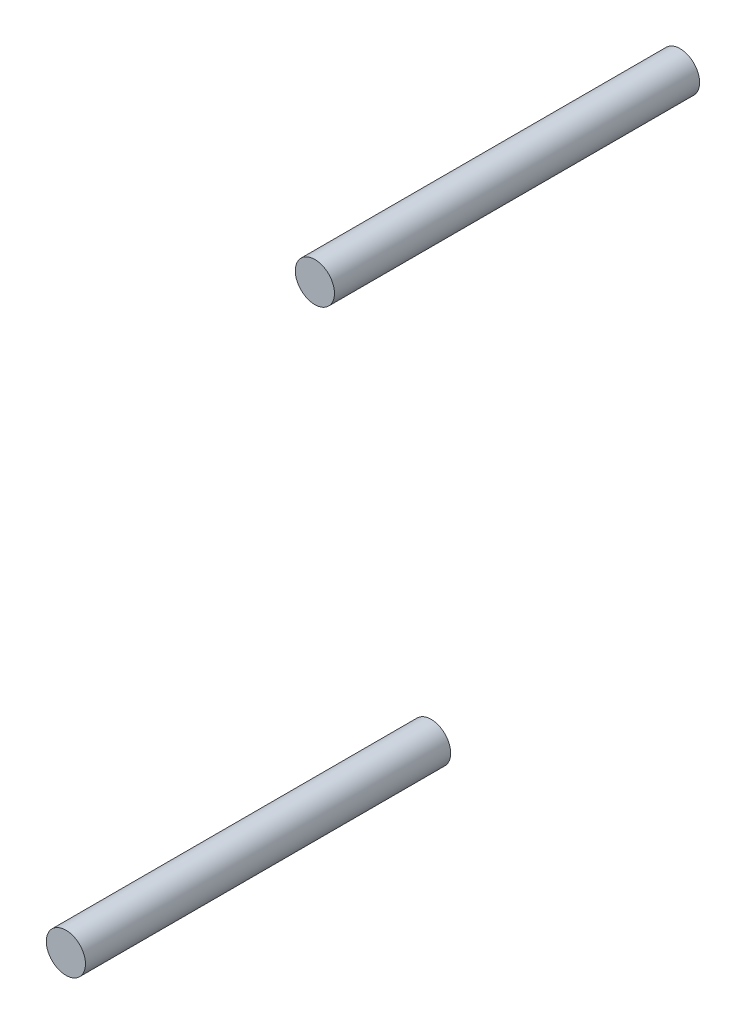
ISO-10303-21;
HEADER;
FILE_DESCRIPTION(('STEP AP214'),'2;1');
FILE_NAME('part.step','',(''),(''),'','','');
FILE_SCHEMA(('AUTOMOTIVE_DESIGN { 1 0 10303 214 1 1 1 1 }'));
ENDSEC;
DATA;
#1=APPLICATION_CONTEXT('core data for automotive mechanical design processes');
#2=APPLICATION_PROTOCOL_DEFINITION('international standard','automotive_design',2000,#1);
#3=PRODUCT_CONTEXT('',#1,'mechanical');
#4=PRODUCT('Part','Part','',(#3));
#5=PRODUCT_RELATED_PRODUCT_CATEGORY('part','',(#4));
#6=PRODUCT_DEFINITION_FORMATION('','',#4);
#7=PRODUCT_DEFINITION_CONTEXT('part definition',#1,'design');
#8=PRODUCT_DEFINITION('design','',#6,#7);
#9=PRODUCT_DEFINITION_SHAPE('','',#8);
#10=(LENGTH_UNIT() NAMED_UNIT(*) SI_UNIT(.MILLI.,.METRE.));
#11=(NAMED_UNIT(*) PLANE_ANGLE_UNIT() SI_UNIT($,.RADIAN.));
#12=(NAMED_UNIT(*) SI_UNIT($,.STERADIAN.) SOLID_ANGLE_UNIT());
#13=UNCERTAINTY_MEASURE_WITH_UNIT(LENGTH_MEASURE(1.E-05),#10,'distance_accuracy_value','');
#14=(GEOMETRIC_REPRESENTATION_CONTEXT(3) GLOBAL_UNCERTAINTY_ASSIGNED_CONTEXT((#13)) GLOBAL_UNIT_ASSIGNED_CONTEXT((#10,
#11,#12)) REPRESENTATION_CONTEXT('',''));
#15=CARTESIAN_POINT('',(0.,0.,0.));
#16=DIRECTION('',(0.,0.,1.));
#17=DIRECTION('',(1.,0.,0.));
#18=AXIS2_PLACEMENT_3D('',#15,#16,#17);
#19=CARTESIAN_POINT('',(-18.0333838044187,-430.13012934603,284.494381904244));
#20=DIRECTION('',(0.,0.,1.));
#21=DIRECTION('',(1.,0.,0.));
#22=AXIS2_PLACEMENT_3D('',#19,#20,#21);
#23=CYLINDRICAL_SURFACE('',#22,6.34999999999998);
#24=CARTESIAN_POINT('',(-18.0333838044187,-430.13012934603,302.454894146383));
#25=DIRECTION('',(0.,0.,1.));
#26=DIRECTION('',(1.,0.,0.));
#27=AXIS2_PLACEMENT_3D('',#24,#25,#26);
#28=CIRCLE('',#27,6.34999999999998);
#29=CARTESIAN_POINT('',(-11.6833838044187,-430.13012934603,302.454894146383));
#30=VERTEX_POINT('',#29);
#31=EDGE_CURVE('E11',#30,#30,#28,.F.);
#32=ORIENTED_EDGE('',*,*,#31,.F.);
#33=EDGE_LOOP('',(#32));
#34=FACE_BOUND('',#33,.T.);
#35=CARTESIAN_POINT('',(-18.0333838044187,-430.13012934603,420.916100000001));
#36=DIRECTION('',(0.,0.,1.));
#37=DIRECTION('',(1.,0.,0.));
#38=AXIS2_PLACEMENT_3D('',#35,#36,#37);
#39=CIRCLE('',#38,6.34999999999998);
#40=CARTESIAN_POINT('',(-11.6833838044187,-430.13012934603,420.916100000001));
#41=VERTEX_POINT('',#40);
#42=EDGE_CURVE('E52',#41,#41,#39,.T.);
#43=ORIENTED_EDGE('',*,*,#42,.F.);
#44=EDGE_LOOP('',(#43));
#45=FACE_BOUND('',#44,.T.);
#46=ADVANCED_FACE('F46',(#34,#45),#23,.T.);
#47=CARTESIAN_POINT('',(-18.0333838044187,-430.13012934603,420.916100000001));
#48=DIRECTION('',(0.,0.,1.));
#49=DIRECTION('',(1.,0.,0.));
#50=AXIS2_PLACEMENT_3D('',#47,#48,#49);
#51=PLANE('',#50);
#52=ORIENTED_EDGE('',*,*,#42,.T.);
#53=EDGE_LOOP('',(#52));
#54=FACE_BOUND('',#53,.T.);
#55=ADVANCED_FACE('F58',(#54),#51,.T.);
#56=CARTESIAN_POINT('',(0.,0.,302.454894146383));
#57=DIRECTION('',(0.,0.,1.));
#58=DIRECTION('',(1.,0.,0.));
#59=AXIS2_PLACEMENT_3D('',#56,#57,#58);
#60=PLANE('',#59);
#61=ORIENTED_EDGE('',*,*,#31,.T.);
#62=EDGE_LOOP('',(#61));
#63=FACE_BOUND('',#62,.T.);
#64=ADVANCED_FACE('F65',(#63),#60,.F.);
#65=CLOSED_SHELL('',(#46,#55,#64));
#66=MANIFOLD_SOLID_BREP('B2',#65);
#67=CARTESIAN_POINT('',(62.7259161955825,-201.35232934603,284.494381904244));
#68=DIRECTION('',(0.,0.,1.));
#69=DIRECTION('',(1.,0.,0.));
#70=AXIS2_PLACEMENT_3D('',#67,#68,#69);
#71=CYLINDRICAL_SURFACE('',#70,6.34999999999999);
#72=CARTESIAN_POINT('',(62.7259161955825,-201.35232934603,302.454894146383));
#73=DIRECTION('',(0.,0.,1.));
#74=DIRECTION('',(1.,0.,0.));
#75=AXIS2_PLACEMENT_3D('',#72,#73,#74);
#76=CIRCLE('',#75,6.34999999999999);
#77=CARTESIAN_POINT('',(69.0759161955825,-201.35232934603,302.454894146383));
#78=VERTEX_POINT('',#77);
#79=EDGE_CURVE('E141',#78,#78,#76,.F.);
#80=ORIENTED_EDGE('',*,*,#79,.F.);
#81=EDGE_LOOP('',(#80));
#82=FACE_BOUND('',#81,.T.);
#83=CARTESIAN_POINT('',(62.7259161955825,-201.35232934603,420.916100000001));
#84=DIRECTION('',(0.,0.,1.));
#85=DIRECTION('',(1.,0.,0.));
#86=AXIS2_PLACEMENT_3D('',#83,#84,#85);
#87=CIRCLE('',#86,6.34999999999999);
#88=CARTESIAN_POINT('',(69.0759161955825,-201.35232934603,420.916100000001));
#89=VERTEX_POINT('',#88);
#90=EDGE_CURVE('E195',#89,#89,#87,.T.);
#91=ORIENTED_EDGE('',*,*,#90,.F.);
#92=EDGE_LOOP('',(#91));
#93=FACE_BOUND('',#92,.T.);
#94=ADVANCED_FACE('F189',(#82,#93),#71,.T.);
#95=CARTESIAN_POINT('',(62.7259161955825,-201.35232934603,420.916100000001));
#96=DIRECTION('',(0.,0.,1.));
#97=DIRECTION('',(1.,0.,0.));
#98=AXIS2_PLACEMENT_3D('',#95,#96,#97);
#99=PLANE('',#98);
#100=ORIENTED_EDGE('',*,*,#90,.T.);
#101=EDGE_LOOP('',(#100));
#102=FACE_BOUND('',#101,.T.);
#103=ADVANCED_FACE('F201',(#102),#99,.T.);
#104=CARTESIAN_POINT('',(0.,0.,302.454894146383));
#105=DIRECTION('',(0.,0.,1.));
#106=DIRECTION('',(1.,0.,0.));
#107=AXIS2_PLACEMENT_3D('',#104,#105,#106);
#108=PLANE('',#107);
#109=ORIENTED_EDGE('',*,*,#79,.T.);
#110=EDGE_LOOP('',(#109));
#111=FACE_BOUND('',#110,.T.);
#112=ADVANCED_FACE('F208',(#111),#108,.F.);
#113=CLOSED_SHELL('',(#94,#103,#112));
#114=MANIFOLD_SOLID_BREP('B89',#113);
#115=ADVANCED_BREP_SHAPE_REPRESENTATION('',(#18,#66,#114),#14);
#116=SHAPE_DEFINITION_REPRESENTATION(#9,#115);
ENDSEC;
END-ISO-10303-21;
